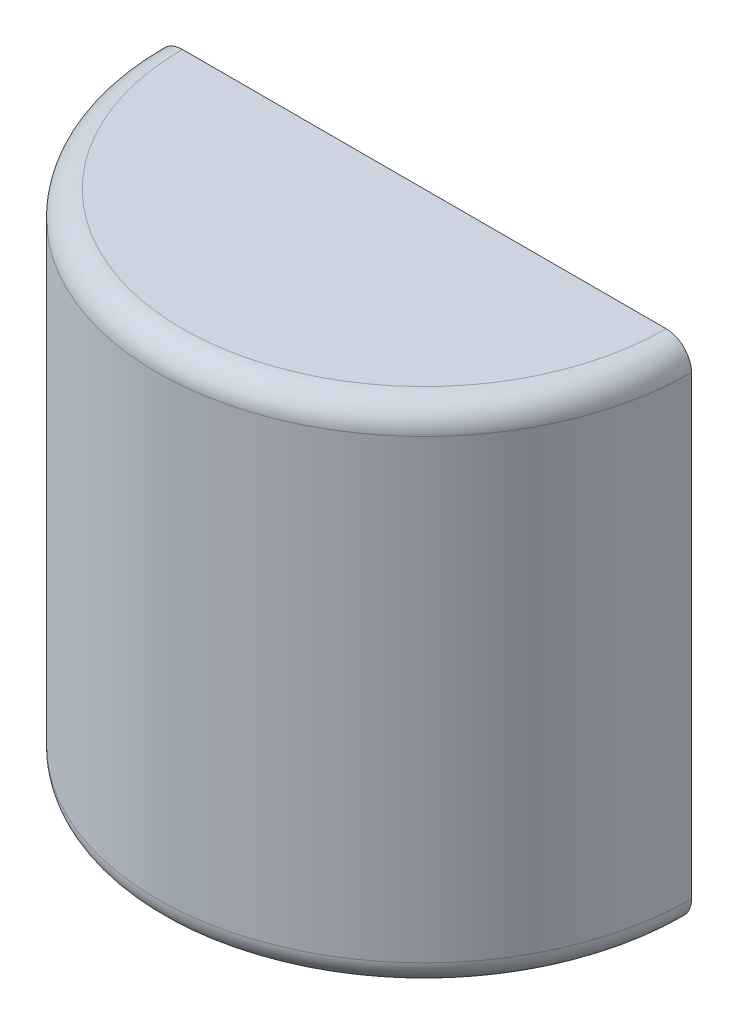
ISO-10303-21;
HEADER;
FILE_DESCRIPTION(('STEP AP214'),'2;1');
FILE_NAME('part.step','',(''),(''),'','','');
FILE_SCHEMA(('AUTOMOTIVE_DESIGN { 1 0 10303 214 1 1 1 1 }'));
ENDSEC;
DATA;
#1=APPLICATION_CONTEXT('core data for automotive mechanical design processes');
#2=APPLICATION_PROTOCOL_DEFINITION('international standard','automotive_design',2000,#1);
#3=PRODUCT_CONTEXT('',#1,'mechanical');
#4=PRODUCT('Part','Part','',(#3));
#5=PRODUCT_RELATED_PRODUCT_CATEGORY('part','',(#4));
#6=PRODUCT_DEFINITION_FORMATION('','',#4);
#7=PRODUCT_DEFINITION_CONTEXT('part definition',#1,'design');
#8=PRODUCT_DEFINITION('design','',#6,#7);
#9=PRODUCT_DEFINITION_SHAPE('','',#8);
#10=(LENGTH_UNIT() NAMED_UNIT(*) SI_UNIT(.MILLI.,.METRE.));
#11=(NAMED_UNIT(*) PLANE_ANGLE_UNIT() SI_UNIT($,.RADIAN.));
#12=(NAMED_UNIT(*) SI_UNIT($,.STERADIAN.) SOLID_ANGLE_UNIT());
#13=UNCERTAINTY_MEASURE_WITH_UNIT(LENGTH_MEASURE(1.E-05),#10,'distance_accuracy_value','');
#14=(GEOMETRIC_REPRESENTATION_CONTEXT(3) GLOBAL_UNCERTAINTY_ASSIGNED_CONTEXT((#13)) GLOBAL_UNIT_ASSIGNED_CONTEXT((#10,
#11,#12)) REPRESENTATION_CONTEXT('',''));
#15=CARTESIAN_POINT('',(0.,0.,0.));
#16=DIRECTION('',(0.,0.,1.));
#17=DIRECTION('',(1.,0.,0.));
#18=AXIS2_PLACEMENT_3D('',#15,#16,#17);
#19=CARTESIAN_POINT('',(0.,254.,0.));
#20=DIRECTION('',(0.,-1.,0.));
#21=DIRECTION('',(0.,0.,-1.));
#22=AXIS2_PLACEMENT_3D('',#19,#20,#21);
#23=PLANE('',#22);
#24=DIRECTION('',(1.,0.,0.));
#25=VECTOR('',#24,1.);
#26=CARTESIAN_POINT('',(0.,254.,0.));
#27=LINE('',#26,#25);
#28=CARTESIAN_POINT('',(-121.285,254.,8.46928628363179E-13));
#29=VERTEX_POINT('',#28);
#30=CARTESIAN_POINT('',(121.285,254.,-8.46928628363179E-13));
#31=VERTEX_POINT('',#30);
#32=EDGE_CURVE('E103',#29,#31,#27,.T.);
#33=ORIENTED_EDGE('',*,*,#32,.F.);
#34=CARTESIAN_POINT('',(0.,254.,0.));
#35=DIRECTION('',(0.,-1.,0.));
#36=DIRECTION('',(0.,0.,-1.));
#37=AXIS2_PLACEMENT_3D('',#34,#35,#36);
#38=CIRCLE('',#37,121.285);
#39=EDGE_CURVE('E11',#29,#31,#38,.F.);
#40=ORIENTED_EDGE('',*,*,#39,.T.);
#41=EDGE_LOOP('',(#33,#40));
#42=FACE_BOUND('',#41,.T.);
#43=ADVANCED_FACE('F33',(#42),#23,.F.);
#44=CARTESIAN_POINT('',(0.,0.,0.));
#45=DIRECTION('',(0.,-1.,0.));
#46=DIRECTION('',(0.,0.,-1.));
#47=AXIS2_PLACEMENT_3D('',#44,#45,#46);
#48=CYLINDRICAL_SURFACE('',#47,133.985);
#49=DIRECTION('',(0.,-1.,0.));
#50=VECTOR('',#49,1.);
#51=CARTESIAN_POINT('',(-133.985,0.,0.));
#52=LINE('',#51,#50);
#53=CARTESIAN_POINT('',(-133.985,241.3,0.));
#54=VERTEX_POINT('',#53);
#55=CARTESIAN_POINT('',(-133.985,12.7,0.));
#56=VERTEX_POINT('',#55);
#57=EDGE_CURVE('E100',#54,#56,#52,.T.);
#58=ORIENTED_EDGE('',*,*,#57,.T.);
#59=CARTESIAN_POINT('',(0.,12.7,0.));
#60=DIRECTION('',(0.,1.,0.));
#61=DIRECTION('',(0.,0.,1.));
#62=AXIS2_PLACEMENT_3D('',#59,#60,#61);
#63=CIRCLE('',#62,133.985);
#64=CARTESIAN_POINT('',(133.985,12.7,-9.35612254369794E-13));
#65=VERTEX_POINT('',#64);
#66=EDGE_CURVE('E41',#56,#65,#63,.T.);
#67=ORIENTED_EDGE('',*,*,#66,.T.);
#68=DIRECTION('',(0.,-1.,0.));
#69=VECTOR('',#68,1.);
#70=CARTESIAN_POINT('',(133.985,0.,-9.35612254369794E-13));
#71=LINE('',#70,#69);
#72=CARTESIAN_POINT('',(133.985,241.3,-9.35612254369794E-13));
#73=VERTEX_POINT('',#72);
#74=EDGE_CURVE('E77',#73,#65,#71,.T.);
#75=ORIENTED_EDGE('',*,*,#74,.F.);
#76=CARTESIAN_POINT('',(0.,241.3,0.));
#77=DIRECTION('',(0.,-1.,0.));
#78=DIRECTION('',(0.,0.,-1.));
#79=AXIS2_PLACEMENT_3D('',#76,#77,#78);
#80=CIRCLE('',#79,133.985);
#81=EDGE_CURVE('E95',#73,#54,#80,.T.);
#82=ORIENTED_EDGE('',*,*,#81,.T.);
#83=EDGE_LOOP('',(#58,#67,#75,#82));
#84=FACE_BOUND('',#83,.T.);
#85=ADVANCED_FACE('F99',(#84),#48,.T.);
#86=CARTESIAN_POINT('',(0.,0.,0.));
#87=DIRECTION('',(0.,1.,0.));
#88=DIRECTION('',(0.,0.,1.));
#89=AXIS2_PLACEMENT_3D('',#86,#87,#88);
#90=PLANE('',#89);
#91=DIRECTION('',(-1.,0.,0.));
#92=VECTOR('',#91,1.);
#93=CARTESIAN_POINT('',(0.,0.,0.));
#94=LINE('',#93,#92);
#95=CARTESIAN_POINT('',(121.285,0.,-8.46928628363179E-13));
#96=VERTEX_POINT('',#95);
#97=CARTESIAN_POINT('',(-121.285,0.,8.46928628363179E-13));
#98=VERTEX_POINT('',#97);
#99=EDGE_CURVE('E76',#96,#98,#94,.T.);
#100=ORIENTED_EDGE('',*,*,#99,.F.);
#101=CARTESIAN_POINT('',(0.,0.,0.));
#102=DIRECTION('',(0.,1.,0.));
#103=DIRECTION('',(0.,0.,1.));
#104=AXIS2_PLACEMENT_3D('',#101,#102,#103);
#105=CIRCLE('',#104,121.285);
#106=EDGE_CURVE('E86',#96,#98,#105,.F.);
#107=ORIENTED_EDGE('',*,*,#106,.T.);
#108=EDGE_LOOP('',(#100,#107));
#109=FACE_BOUND('',#108,.T.);
#110=ADVANCED_FACE('F85',(#109),#90,.F.);
#111=CARTESIAN_POINT('',(0.,0.,0.));
#112=DIRECTION('',(0.,0.,-1.));
#113=DIRECTION('',(-1.,0.,0.));
#114=AXIS2_PLACEMENT_3D('',#111,#112,#113);
#115=PLANE('',#114);
#116=ORIENTED_EDGE('',*,*,#99,.T.);
#117=CARTESIAN_POINT('',(-121.285,12.7,8.46928628363179E-13));
#118=DIRECTION('',(0.,0.,-1.));
#119=DIRECTION('',(-1.,0.,0.));
#120=AXIS2_PLACEMENT_3D('',#117,#118,#119);
#121=CIRCLE('',#120,12.7);
#122=EDGE_CURVE('E80',#98,#56,#121,.T.);
#123=ORIENTED_EDGE('',*,*,#122,.T.);
#124=ORIENTED_EDGE('',*,*,#57,.F.);
#125=CARTESIAN_POINT('',(-121.285,241.3,8.46928628363179E-13));
#126=DIRECTION('',(0.,0.,-1.));
#127=DIRECTION('',(-1.,0.,0.));
#128=AXIS2_PLACEMENT_3D('',#125,#126,#127);
#129=CIRCLE('',#128,12.7);
#130=EDGE_CURVE('E81',#54,#29,#129,.T.);
#131=ORIENTED_EDGE('',*,*,#130,.T.);
#132=ORIENTED_EDGE('',*,*,#32,.T.);
#133=CARTESIAN_POINT('',(121.285,241.3,-8.46928628363179E-13));
#134=DIRECTION('',(0.,0.,-1.));
#135=DIRECTION('',(-1.,0.,0.));
#136=AXIS2_PLACEMENT_3D('',#133,#134,#135);
#137=CIRCLE('',#136,12.7);
#138=EDGE_CURVE('E54',#31,#73,#137,.T.);
#139=ORIENTED_EDGE('',*,*,#138,.T.);
#140=ORIENTED_EDGE('',*,*,#74,.T.);
#141=CARTESIAN_POINT('',(121.285,12.7,-8.46928628363179E-13));
#142=DIRECTION('',(0.,0.,-1.));
#143=DIRECTION('',(-1.,0.,0.));
#144=AXIS2_PLACEMENT_3D('',#141,#142,#143);
#145=CIRCLE('',#144,12.7);
#146=EDGE_CURVE('E73',#65,#96,#145,.T.);
#147=ORIENTED_EDGE('',*,*,#146,.T.);
#148=EDGE_LOOP('',(#116,#123,#124,#131,#132,#139,#140,#147));
#149=FACE_BOUND('',#148,.T.);
#150=ADVANCED_FACE('F75',(#149),#115,.T.);
#151=CARTESIAN_POINT('',(0.,12.7,0.));
#152=DIRECTION('',(0.,1.,0.));
#153=DIRECTION('',(0.,0.,1.));
#154=AXIS2_PLACEMENT_3D('',#151,#152,#153);
#155=TOROIDAL_SURFACE('',#154,121.285,12.7);
#156=ORIENTED_EDGE('',*,*,#146,.F.);
#157=ORIENTED_EDGE('',*,*,#66,.F.);
#158=ORIENTED_EDGE('',*,*,#122,.F.);
#159=ORIENTED_EDGE('',*,*,#106,.F.);
#160=EDGE_LOOP('',(#156,#157,#158,#159));
#161=FACE_BOUND('',#160,.T.);
#162=ADVANCED_FACE('F88',(#161),#155,.T.);
#163=CARTESIAN_POINT('',(0.,241.3,0.));
#164=DIRECTION('',(0.,-1.,0.));
#165=DIRECTION('',(0.,0.,-1.));
#166=AXIS2_PLACEMENT_3D('',#163,#164,#165);
#167=TOROIDAL_SURFACE('',#166,121.285,12.7);
#168=ORIENTED_EDGE('',*,*,#138,.F.);
#169=ORIENTED_EDGE('',*,*,#39,.F.);
#170=ORIENTED_EDGE('',*,*,#130,.F.);
#171=ORIENTED_EDGE('',*,*,#81,.F.);
#172=EDGE_LOOP('',(#168,#169,#170,#171));
#173=FACE_BOUND('',#172,.T.);
#174=ADVANCED_FACE('F35',(#173),#167,.T.);
#175=CLOSED_SHELL('',(#43,#85,#110,#150,#162,#174));
#176=MANIFOLD_SOLID_BREP('B2',#175);
#177=ADVANCED_BREP_SHAPE_REPRESENTATION('',(#18,#176),#14);
#178=SHAPE_DEFINITION_REPRESENTATION(#9,#177);
ENDSEC;
END-ISO-10303-21;
